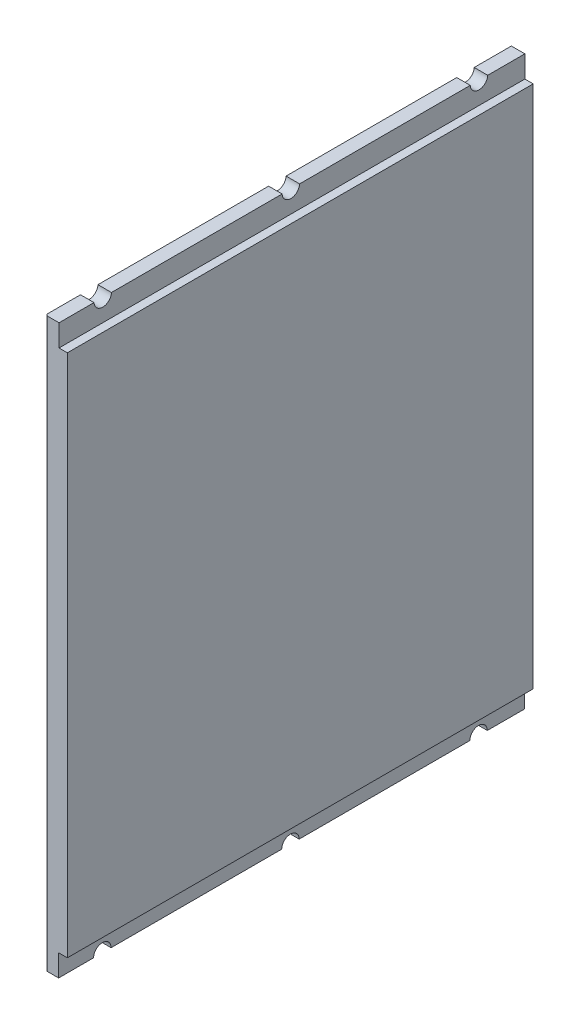
ISO-10303-21;
HEADER;
FILE_DESCRIPTION(('STEP AP214'),'2;1');
FILE_NAME('part.step','',(''),(''),'','','');
FILE_SCHEMA(('AUTOMOTIVE_DESIGN { 1 0 10303 214 1 1 1 1 }'));
ENDSEC;
DATA;
#1=APPLICATION_CONTEXT('core data for automotive mechanical design processes');
#2=APPLICATION_PROTOCOL_DEFINITION('international standard','automotive_design',2000,#1);
#3=PRODUCT_CONTEXT('',#1,'mechanical');
#4=PRODUCT('Part','Part','',(#3));
#5=PRODUCT_RELATED_PRODUCT_CATEGORY('part','',(#4));
#6=PRODUCT_DEFINITION_FORMATION('','',#4);
#7=PRODUCT_DEFINITION_CONTEXT('part definition',#1,'design');
#8=PRODUCT_DEFINITION('design','',#6,#7);
#9=PRODUCT_DEFINITION_SHAPE('','',#8);
#10=(LENGTH_UNIT() NAMED_UNIT(*) SI_UNIT(.MILLI.,.METRE.));
#11=(NAMED_UNIT(*) PLANE_ANGLE_UNIT() SI_UNIT($,.RADIAN.));
#12=(NAMED_UNIT(*) SI_UNIT($,.STERADIAN.) SOLID_ANGLE_UNIT());
#13=UNCERTAINTY_MEASURE_WITH_UNIT(LENGTH_MEASURE(1.E-05),#10,'distance_accuracy_value','');
#14=(GEOMETRIC_REPRESENTATION_CONTEXT(3) GLOBAL_UNCERTAINTY_ASSIGNED_CONTEXT((#13)) GLOBAL_UNIT_ASSIGNED_CONTEXT((#10,
#11,#12)) REPRESENTATION_CONTEXT('',''));
#15=CARTESIAN_POINT('',(0.,0.,0.));
#16=DIRECTION('',(0.,0.,1.));
#17=DIRECTION('',(1.,0.,0.));
#18=AXIS2_PLACEMENT_3D('',#15,#16,#17);
#19=CARTESIAN_POINT('',(3.0954492315529,164.904550768447,2.99000000000001));
#20=DIRECTION('',(-1.,0.,0.));
#21=DIRECTION('',(0.,-1.,0.));
#22=AXIS2_PLACEMENT_3D('',#19,#20,#21);
#23=PLANE('',#22);
#24=DIRECTION('',(0.,0.,1.));
#25=VECTOR('',#24,1.);
#26=CARTESIAN_POINT('',(3.0954492315529,164.904550768447,2.99000000000001));
#27=LINE('',#26,#25);
#28=CARTESIAN_POINT('',(3.0954492315529,164.904550768447,3.));
#29=VERTEX_POINT('',#28);
#30=CARTESIAN_POINT('',(3.0954492315529,164.904550768447,11.5022789373399));
#31=VERTEX_POINT('',#30);
#32=EDGE_CURVE('E208',#29,#31,#27,.T.);
#33=ORIENTED_EDGE('',*,*,#32,.T.);
#34=CARTESIAN_POINT('',(3.0954492315529,165.,13.5));
#35=DIRECTION('',(-1.,0.,0.));
#36=DIRECTION('',(0.,-1.,0.));
#37=AXIS2_PLACEMENT_3D('',#34,#35,#36);
#38=CIRCLE('',#37,2.);
#39=CARTESIAN_POINT('',(3.0954492315529,164.904550768447,15.4977210626601));
#40=VERTEX_POINT('',#39);
#41=EDGE_CURVE('E292',#40,#31,#38,.F.);
#42=ORIENTED_EDGE('',*,*,#41,.F.);
#43=CARTESIAN_POINT('',(3.0954492315529,164.904550768447,54.5522789373399));
#44=VERTEX_POINT('',#43);
#45=EDGE_CURVE('E282',#40,#44,#27,.T.);
#46=ORIENTED_EDGE('',*,*,#45,.T.);
#47=CARTESIAN_POINT('',(3.0954492315529,165.,56.55));
#48=DIRECTION('',(-1.,0.,0.));
#49=DIRECTION('',(0.,-1.,0.));
#50=AXIS2_PLACEMENT_3D('',#47,#48,#49);
#51=CIRCLE('',#50,2.);
#52=CARTESIAN_POINT('',(3.0954492315529,164.904550768447,58.5477210626601));
#53=VERTEX_POINT('',#52);
#54=EDGE_CURVE('E290',#53,#44,#51,.F.);
#55=ORIENTED_EDGE('',*,*,#54,.F.);
#56=CARTESIAN_POINT('',(3.0954492315529,164.904550768447,97.6022789373399));
#57=VERTEX_POINT('',#56);
#58=EDGE_CURVE('E277',#53,#57,#27,.T.);
#59=ORIENTED_EDGE('',*,*,#58,.T.);
#60=CARTESIAN_POINT('',(3.0954492315529,165.,99.6));
#61=DIRECTION('',(-1.,0.,0.));
#62=DIRECTION('',(0.,-1.,0.));
#63=AXIS2_PLACEMENT_3D('',#60,#61,#62);
#64=CIRCLE('',#63,2.);
#65=CARTESIAN_POINT('',(3.0954492315529,164.904550768447,101.59772106266));
#66=VERTEX_POINT('',#65);
#67=EDGE_CURVE('E250',#66,#57,#64,.F.);
#68=ORIENTED_EDGE('',*,*,#67,.F.);
#69=CARTESIAN_POINT('',(3.0954492315529,164.904550768447,109.6));
#70=VERTEX_POINT('',#69);
#71=EDGE_CURVE('E275',#66,#70,#27,.T.);
#72=ORIENTED_EDGE('',*,*,#71,.T.);
#73=DIRECTION('',(0.,1.,0.));
#74=VECTOR('',#73,1.);
#75=CARTESIAN_POINT('',(3.09544923155291,0.,109.6));
#76=LINE('',#75,#74);
#77=CARTESIAN_POINT('',(3.0954492315529,159.904550768447,109.6));
#78=VERTEX_POINT('',#77);
#79=EDGE_CURVE('E322',#78,#70,#76,.T.);
#80=ORIENTED_EDGE('',*,*,#79,.F.);
#81=DIRECTION('',(0.,0.,1.));
#82=VECTOR('',#81,1.);
#83=CARTESIAN_POINT('',(3.0954492315529,159.904550768447,2.99000000000001));
#84=LINE('',#83,#82);
#85=CARTESIAN_POINT('',(3.0954492315529,159.904550768447,3.));
#86=VERTEX_POINT('',#85);
#87=EDGE_CURVE('E37',#86,#78,#84,.T.);
#88=ORIENTED_EDGE('',*,*,#87,.F.);
#89=DIRECTION('',(0.,-1.,0.));
#90=VECTOR('',#89,1.);
#91=CARTESIAN_POINT('',(3.09544923155291,0.,3.));
#92=LINE('',#91,#90);
#93=EDGE_CURVE('E315',#29,#86,#92,.T.);
#94=ORIENTED_EDGE('',*,*,#93,.F.);
#95=EDGE_LOOP('',(#33,#42,#46,#55,#59,#68,#72,#80,#88,#94));
#96=FACE_BOUND('',#95,.T.);
#97=ADVANCED_FACE('F33',(#96),#23,.F.);
#98=CARTESIAN_POINT('',(-4.15190183256233,164.904550768447,2.99000000000001));
#99=DIRECTION('',(0.,-1.,0.));
#100=DIRECTION('',(0.,0.,-1.));
#101=AXIS2_PLACEMENT_3D('',#98,#99,#100);
#102=PLANE('',#101);
#103=DIRECTION('',(0.,0.,-1.));
#104=VECTOR('',#103,1.);
#105=CARTESIAN_POINT('',(0.,164.904550768447,109.6));
#106=LINE('',#105,#104);
#107=CARTESIAN_POINT('',(0.,164.904550768447,11.5022789373399));
#108=VERTEX_POINT('',#107);
#109=CARTESIAN_POINT('',(0.,164.904550768447,3.));
#110=VERTEX_POINT('',#109);
#111=EDGE_CURVE('E240',#108,#110,#106,.T.);
#112=ORIENTED_EDGE('',*,*,#111,.F.);
#113=DIRECTION('',(-1.,0.,0.));
#114=VECTOR('',#113,1.);
#115=CARTESIAN_POINT('',(10.,164.904550768447,11.5022789373399));
#116=LINE('',#115,#114);
#117=EDGE_CURVE('E318',#31,#108,#116,.T.);
#118=ORIENTED_EDGE('',*,*,#117,.F.);
#119=ORIENTED_EDGE('',*,*,#32,.F.);
#120=DIRECTION('',(1.,0.,0.));
#121=VECTOR('',#120,1.);
#122=CARTESIAN_POINT('',(-0.01000000000001,164.904550768447,3.));
#123=LINE('',#122,#121);
#124=EDGE_CURVE('E233',#110,#29,#123,.T.);
#125=ORIENTED_EDGE('',*,*,#124,.F.);
#126=EDGE_LOOP('',(#112,#118,#119,#125));
#127=FACE_BOUND('',#126,.T.);
#128=ADVANCED_FACE('F384',(#127),#102,.F.);
#129=CARTESIAN_POINT('',(5.,159.904550768447,2.99000000000001));
#130=DIRECTION('',(0.,-1.,0.));
#131=DIRECTION('',(0.,0.,-1.));
#132=AXIS2_PLACEMENT_3D('',#129,#130,#131);
#133=PLANE('',#132);
#134=ORIENTED_EDGE('',*,*,#87,.T.);
#135=DIRECTION('',(-1.,0.,0.));
#136=VECTOR('',#135,1.);
#137=CARTESIAN_POINT('',(0.,159.904550768447,109.6));
#138=LINE('',#137,#136);
#139=CARTESIAN_POINT('',(5.,159.904550768447,109.6));
#140=VERTEX_POINT('',#139);
#141=EDGE_CURVE('E324',#140,#78,#138,.T.);
#142=ORIENTED_EDGE('',*,*,#141,.F.);
#143=DIRECTION('',(0.,0.,1.));
#144=VECTOR('',#143,1.);
#145=CARTESIAN_POINT('',(5.,159.904550768447,2.99000000000001));
#146=LINE('',#145,#144);
#147=CARTESIAN_POINT('',(5.,159.904550768447,3.));
#148=VERTEX_POINT('',#147);
#149=EDGE_CURVE('E235',#148,#140,#146,.T.);
#150=ORIENTED_EDGE('',*,*,#149,.F.);
#151=DIRECTION('',(1.,0.,0.));
#152=VECTOR('',#151,1.);
#153=CARTESIAN_POINT('',(-0.01000000000001,159.904550768447,3.));
#154=LINE('',#153,#152);
#155=EDGE_CURVE('E317',#86,#148,#154,.T.);
#156=ORIENTED_EDGE('',*,*,#155,.F.);
#157=EDGE_LOOP('',(#134,#142,#150,#156));
#158=FACE_BOUND('',#157,.T.);
#159=ADVANCED_FACE('F385',(#158),#133,.F.);
#160=CARTESIAN_POINT('',(0.5,164.904550768447,109.1));
#161=DIRECTION('',(0.,-1.,0.));
#162=DIRECTION('',(0.,0.,-1.));
#163=AXIS2_PLACEMENT_3D('',#160,#161,#162);
#164=CIRCLE('',#163,0.5);
#165=CARTESIAN_POINT('',(0.,164.904550768447,109.1));
#166=VERTEX_POINT('',#165);
#167=CARTESIAN_POINT('',(0.5,164.904550768447,109.6));
#168=VERTEX_POINT('',#167);
#169=EDGE_CURVE('E211',#166,#168,#164,.F.);
#170=ORIENTED_EDGE('',*,*,#169,.T.);
#171=DIRECTION('',(-1.,0.,0.));
#172=VECTOR('',#171,1.);
#173=CARTESIAN_POINT('',(0.,164.904550768447,109.6));
#174=LINE('',#173,#172);
#175=EDGE_CURVE('E245',#70,#168,#174,.T.);
#176=ORIENTED_EDGE('',*,*,#175,.F.);
#177=ORIENTED_EDGE('',*,*,#71,.F.);
#178=DIRECTION('',(-1.,0.,0.));
#179=VECTOR('',#178,1.);
#180=CARTESIAN_POINT('',(10.,164.904550768447,101.59772106266));
#181=LINE('',#180,#179);
#182=CARTESIAN_POINT('',(0.,164.904550768447,101.59772106266));
#183=VERTEX_POINT('',#182);
#184=EDGE_CURVE('E305',#183,#66,#181,.F.);
#185=ORIENTED_EDGE('',*,*,#184,.F.);
#186=EDGE_CURVE('E312',#166,#183,#106,.T.);
#187=ORIENTED_EDGE('',*,*,#186,.F.);
#188=EDGE_LOOP('',(#170,#176,#177,#185,#187));
#189=FACE_BOUND('',#188,.T.);
#190=ADVANCED_FACE('F374',(#189),#102,.F.);
#191=CARTESIAN_POINT('',(0.,164.904550768447,97.6022789373399));
#192=VERTEX_POINT('',#191);
#193=CARTESIAN_POINT('',(0.,164.904550768447,58.5477210626601));
#194=VERTEX_POINT('',#193);
#195=EDGE_CURVE('E314',#192,#194,#106,.T.);
#196=ORIENTED_EDGE('',*,*,#195,.F.);
#197=DIRECTION('',(-1.,0.,0.));
#198=VECTOR('',#197,1.);
#199=CARTESIAN_POINT('',(10.,164.904550768447,97.6022789373399));
#200=LINE('',#199,#198);
#201=EDGE_CURVE('E329',#57,#192,#200,.T.);
#202=ORIENTED_EDGE('',*,*,#201,.F.);
#203=ORIENTED_EDGE('',*,*,#58,.F.);
#204=DIRECTION('',(-1.,0.,0.));
#205=VECTOR('',#204,1.);
#206=CARTESIAN_POINT('',(10.,164.904550768447,58.5477210626601));
#207=LINE('',#206,#205);
#208=EDGE_CURVE('E303',#194,#53,#207,.F.);
#209=ORIENTED_EDGE('',*,*,#208,.F.);
#210=EDGE_LOOP('',(#196,#202,#203,#209));
#211=FACE_BOUND('',#210,.T.);
#212=ADVANCED_FACE('F377',(#211),#102,.F.);
#213=CARTESIAN_POINT('',(0.,164.904550768447,54.5522789373399));
#214=VERTEX_POINT('',#213);
#215=CARTESIAN_POINT('',(0.,164.904550768447,15.4977210626601));
#216=VERTEX_POINT('',#215);
#217=EDGE_CURVE('E299',#214,#216,#106,.T.);
#218=ORIENTED_EDGE('',*,*,#217,.F.);
#219=DIRECTION('',(-1.,0.,0.));
#220=VECTOR('',#219,1.);
#221=CARTESIAN_POINT('',(10.,164.904550768447,54.5522789373399));
#222=LINE('',#221,#220);
#223=EDGE_CURVE('E296',#44,#214,#222,.T.);
#224=ORIENTED_EDGE('',*,*,#223,.F.);
#225=ORIENTED_EDGE('',*,*,#45,.F.);
#226=DIRECTION('',(-1.,0.,0.));
#227=VECTOR('',#226,1.);
#228=CARTESIAN_POINT('',(10.,164.904550768447,15.4977210626601));
#229=LINE('',#228,#227);
#230=EDGE_CURVE('E309',#216,#40,#229,.F.);
#231=ORIENTED_EDGE('',*,*,#230,.F.);
#232=EDGE_LOOP('',(#218,#224,#225,#231));
#233=FACE_BOUND('',#232,.T.);
#234=ADVANCED_FACE('F297',(#233),#102,.F.);
#235=CARTESIAN_POINT('',(-24.2516647448894,35.,2.99000000000001));
#236=DIRECTION('',(0.,1.,0.));
#237=DIRECTION('',(0.,0.,1.));
#238=AXIS2_PLACEMENT_3D('',#235,#236,#237);
#239=PLANE('',#238);
#240=DIRECTION('',(0.,0.,1.));
#241=VECTOR('',#240,1.);
#242=CARTESIAN_POINT('',(3.,35.,2.99000000000001));
#243=LINE('',#242,#241);
#244=CARTESIAN_POINT('',(3.,35.,3.));
#245=VERTEX_POINT('',#244);
#246=CARTESIAN_POINT('',(3.,35.,11.5));
#247=VERTEX_POINT('',#246);
#248=EDGE_CURVE('E199',#245,#247,#243,.T.);
#249=ORIENTED_EDGE('',*,*,#248,.T.);
#250=DIRECTION('',(-1.,0.,0.));
#251=VECTOR('',#250,1.);
#252=CARTESIAN_POINT('',(10.,35.,11.5));
#253=LINE('',#252,#251);
#254=CARTESIAN_POINT('',(0.,35.,11.5));
#255=VERTEX_POINT('',#254);
#256=EDGE_CURVE('E190',#255,#247,#253,.F.);
#257=ORIENTED_EDGE('',*,*,#256,.F.);
#258=DIRECTION('',(0.,0.,1.));
#259=VECTOR('',#258,1.);
#260=CARTESIAN_POINT('',(0.,35.,109.6));
#261=LINE('',#260,#259);
#262=CARTESIAN_POINT('',(0.,35.,3.));
#263=VERTEX_POINT('',#262);
#264=EDGE_CURVE('E50',#263,#255,#261,.T.);
#265=ORIENTED_EDGE('',*,*,#264,.F.);
#266=DIRECTION('',(-1.,0.,0.));
#267=VECTOR('',#266,1.);
#268=CARTESIAN_POINT('',(-0.01000000000001,35.,3.));
#269=LINE('',#268,#267);
#270=EDGE_CURVE('E231',#245,#263,#269,.T.);
#271=ORIENTED_EDGE('',*,*,#270,.F.);
#272=EDGE_LOOP('',(#249,#257,#265,#271));
#273=FACE_BOUND('',#272,.T.);
#274=ADVANCED_FACE('F352',(#273),#239,.F.);
#275=CARTESIAN_POINT('',(0.,35.,15.5));
#276=VERTEX_POINT('',#275);
#277=CARTESIAN_POINT('',(0.,35.,54.55));
#278=VERTEX_POINT('',#277);
#279=EDGE_CURVE('E184',#276,#278,#261,.T.);
#280=ORIENTED_EDGE('',*,*,#279,.F.);
#281=DIRECTION('',(-1.,0.,0.));
#282=VECTOR('',#281,1.);
#283=CARTESIAN_POINT('',(10.,35.,15.5));
#284=LINE('',#283,#282);
#285=CARTESIAN_POINT('',(3.,35.,15.5));
#286=VERTEX_POINT('',#285);
#287=EDGE_CURVE('E57',#286,#276,#284,.T.);
#288=ORIENTED_EDGE('',*,*,#287,.F.);
#289=CARTESIAN_POINT('',(3.,35.,54.55));
#290=VERTEX_POINT('',#289);
#291=EDGE_CURVE('E181',#286,#290,#243,.T.);
#292=ORIENTED_EDGE('',*,*,#291,.T.);
#293=DIRECTION('',(-1.,0.,0.));
#294=VECTOR('',#293,1.);
#295=CARTESIAN_POINT('',(10.,35.,54.55));
#296=LINE('',#295,#294);
#297=EDGE_CURVE('E254',#278,#290,#296,.F.);
#298=ORIENTED_EDGE('',*,*,#297,.F.);
#299=EDGE_LOOP('',(#280,#288,#292,#298));
#300=FACE_BOUND('',#299,.T.);
#301=ADVANCED_FACE('F179',(#300),#239,.F.);
#302=CARTESIAN_POINT('',(3.,40.,2.99000000000001));
#303=DIRECTION('',(-1.,0.,0.));
#304=DIRECTION('',(0.,-1.,0.));
#305=AXIS2_PLACEMENT_3D('',#302,#303,#304);
#306=PLANE('',#305);
#307=DIRECTION('',(0.,0.,1.));
#308=VECTOR('',#307,1.);
#309=CARTESIAN_POINT('',(3.,40.,2.99000000000001));
#310=LINE('',#309,#308);
#311=CARTESIAN_POINT('',(3.,40.,3.));
#312=VERTEX_POINT('',#311);
#313=CARTESIAN_POINT('',(3.,40.,109.6));
#314=VERTEX_POINT('',#313);
#315=EDGE_CURVE('E202',#312,#314,#310,.T.);
#316=ORIENTED_EDGE('',*,*,#315,.T.);
#317=DIRECTION('',(0.,1.,0.));
#318=VECTOR('',#317,1.);
#319=CARTESIAN_POINT('',(3.,0.,109.6));
#320=LINE('',#319,#318);
#321=CARTESIAN_POINT('',(3.,35.,109.6));
#322=VERTEX_POINT('',#321);
#323=EDGE_CURVE('E239',#322,#314,#320,.T.);
#324=ORIENTED_EDGE('',*,*,#323,.F.);
#325=CARTESIAN_POINT('',(3.,35.,101.6));
#326=VERTEX_POINT('',#325);
#327=EDGE_CURVE('E203',#326,#322,#243,.T.);
#328=ORIENTED_EDGE('',*,*,#327,.F.);
#329=CARTESIAN_POINT('',(3.,35.,99.6));
#330=DIRECTION('',(-1.,0.,0.));
#331=DIRECTION('',(0.,-1.,0.));
#332=AXIS2_PLACEMENT_3D('',#329,#330,#331);
#333=CIRCLE('',#332,2.);
#334=CARTESIAN_POINT('',(3.,35.,97.6));
#335=VERTEX_POINT('',#334);
#336=EDGE_CURVE('E249',#335,#326,#333,.F.);
#337=ORIENTED_EDGE('',*,*,#336,.F.);
#338=CARTESIAN_POINT('',(3.,35.,58.55));
#339=VERTEX_POINT('',#338);
#340=EDGE_CURVE('E200',#339,#335,#243,.T.);
#341=ORIENTED_EDGE('',*,*,#340,.F.);
#342=CARTESIAN_POINT('',(3.,35.,56.55));
#343=DIRECTION('',(-1.,0.,0.));
#344=DIRECTION('',(0.,-1.,0.));
#345=AXIS2_PLACEMENT_3D('',#342,#343,#344);
#346=CIRCLE('',#345,2.00000000000001);
#347=EDGE_CURVE('E198',#290,#339,#346,.F.);
#348=ORIENTED_EDGE('',*,*,#347,.F.);
#349=ORIENTED_EDGE('',*,*,#291,.F.);
#350=CARTESIAN_POINT('',(3.,35.,13.5));
#351=DIRECTION('',(-1.,0.,0.));
#352=DIRECTION('',(0.,-1.,0.));
#353=AXIS2_PLACEMENT_3D('',#350,#351,#352);
#354=CIRCLE('',#353,2.);
#355=EDGE_CURVE('E186',#247,#286,#354,.F.);
#356=ORIENTED_EDGE('',*,*,#355,.F.);
#357=ORIENTED_EDGE('',*,*,#248,.F.);
#358=DIRECTION('',(0.,-1.,0.));
#359=VECTOR('',#358,1.);
#360=CARTESIAN_POINT('',(3.,0.,3.));
#361=LINE('',#360,#359);
#362=EDGE_CURVE('E228',#312,#245,#361,.T.);
#363=ORIENTED_EDGE('',*,*,#362,.F.);
#364=EDGE_LOOP('',(#316,#324,#328,#337,#341,#348,#349,#356,#357,#363));
#365=FACE_BOUND('',#364,.T.);
#366=ADVANCED_FACE('F196',(#365),#306,.F.);
#367=CARTESIAN_POINT('',(5.,40.,2.99000000000001));
#368=DIRECTION('',(0.,1.,0.));
#369=DIRECTION('',(0.,0.,1.));
#370=AXIS2_PLACEMENT_3D('',#367,#368,#369);
#371=PLANE('',#370);
#372=DIRECTION('',(0.,0.,1.));
#373=VECTOR('',#372,1.);
#374=CARTESIAN_POINT('',(5.,40.,109.6));
#375=LINE('',#374,#373);
#376=CARTESIAN_POINT('',(5.,40.,3.));
#377=VERTEX_POINT('',#376);
#378=CARTESIAN_POINT('',(5.,40.,109.6));
#379=VERTEX_POINT('',#378);
#380=EDGE_CURVE('E222',#377,#379,#375,.T.);
#381=ORIENTED_EDGE('',*,*,#380,.T.);
#382=DIRECTION('',(1.,0.,0.));
#383=VECTOR('',#382,1.);
#384=CARTESIAN_POINT('',(0.,40.,109.6));
#385=LINE('',#384,#383);
#386=EDGE_CURVE('E237',#314,#379,#385,.T.);
#387=ORIENTED_EDGE('',*,*,#386,.F.);
#388=ORIENTED_EDGE('',*,*,#315,.F.);
#389=DIRECTION('',(-1.,0.,0.));
#390=VECTOR('',#389,1.);
#391=CARTESIAN_POINT('',(-0.01000000000001,40.,3.));
#392=LINE('',#391,#390);
#393=EDGE_CURVE('E225',#377,#312,#392,.T.);
#394=ORIENTED_EDGE('',*,*,#393,.F.);
#395=EDGE_LOOP('',(#381,#387,#388,#394));
#396=FACE_BOUND('',#395,.T.);
#397=ADVANCED_FACE('F409',(#396),#371,.F.);
#398=CARTESIAN_POINT('',(0.,35.,58.55));
#399=VERTEX_POINT('',#398);
#400=CARTESIAN_POINT('',(0.,35.,97.6));
#401=VERTEX_POINT('',#400);
#402=EDGE_CURVE('E355',#399,#401,#261,.T.);
#403=ORIENTED_EDGE('',*,*,#402,.F.);
#404=DIRECTION('',(-1.,0.,0.));
#405=VECTOR('',#404,1.);
#406=CARTESIAN_POINT('',(10.,35.,58.55));
#407=LINE('',#406,#405);
#408=EDGE_CURVE('E257',#339,#399,#407,.T.);
#409=ORIENTED_EDGE('',*,*,#408,.F.);
#410=ORIENTED_EDGE('',*,*,#340,.T.);
#411=DIRECTION('',(-1.,0.,0.));
#412=VECTOR('',#411,1.);
#413=CARTESIAN_POINT('',(10.,35.,97.6));
#414=LINE('',#413,#412);
#415=EDGE_CURVE('E246',#401,#335,#414,.F.);
#416=ORIENTED_EDGE('',*,*,#415,.F.);
#417=EDGE_LOOP('',(#403,#409,#410,#416));
#418=FACE_BOUND('',#417,.T.);
#419=ADVANCED_FACE('F361',(#418),#239,.F.);
#420=CARTESIAN_POINT('',(0.5,35.,109.1));
#421=DIRECTION('',(0.,1.,0.));
#422=DIRECTION('',(0.,0.,1.));
#423=AXIS2_PLACEMENT_3D('',#420,#421,#422);
#424=CIRCLE('',#423,0.5);
#425=CARTESIAN_POINT('',(0.5,35.,109.6));
#426=VERTEX_POINT('',#425);
#427=CARTESIAN_POINT('',(0.,35.,109.1));
#428=VERTEX_POINT('',#427);
#429=EDGE_CURVE('E219',#426,#428,#424,.F.);
#430=ORIENTED_EDGE('',*,*,#429,.T.);
#431=CARTESIAN_POINT('',(0.,35.,101.6));
#432=VERTEX_POINT('',#431);
#433=EDGE_CURVE('E236',#432,#428,#261,.T.);
#434=ORIENTED_EDGE('',*,*,#433,.F.);
#435=DIRECTION('',(-1.,0.,0.));
#436=VECTOR('',#435,1.);
#437=CARTESIAN_POINT('',(10.,35.,101.6));
#438=LINE('',#437,#436);
#439=EDGE_CURVE('E252',#326,#432,#438,.T.);
#440=ORIENTED_EDGE('',*,*,#439,.F.);
#441=ORIENTED_EDGE('',*,*,#327,.T.);
#442=DIRECTION('',(1.,0.,0.));
#443=VECTOR('',#442,1.);
#444=CARTESIAN_POINT('',(0.,35.,109.6));
#445=LINE('',#444,#443);
#446=EDGE_CURVE('E242',#426,#322,#445,.T.);
#447=ORIENTED_EDGE('',*,*,#446,.F.);
#448=EDGE_LOOP('',(#430,#434,#440,#441,#447));
#449=FACE_BOUND('',#448,.T.);
#450=ADVANCED_FACE('F368',(#449),#239,.F.);
#451=CARTESIAN_POINT('',(-0.01000000000001,0.,3.));
#452=DIRECTION('',(0.,0.,1.));
#453=DIRECTION('',(1.,0.,0.));
#454=AXIS2_PLACEMENT_3D('',#451,#452,#453);
#455=PLANE('',#454);
#456=DIRECTION('',(0.,-1.,0.));
#457=VECTOR('',#456,1.);
#458=CARTESIAN_POINT('',(5.,192.,3.));
#459=LINE('',#458,#457);
#460=EDGE_CURVE('E185',#148,#377,#459,.T.);
#461=ORIENTED_EDGE('',*,*,#460,.T.);
#462=ORIENTED_EDGE('',*,*,#393,.T.);
#463=ORIENTED_EDGE('',*,*,#362,.T.);
#464=ORIENTED_EDGE('',*,*,#270,.T.);
#465=DIRECTION('',(0.,-1.,0.));
#466=VECTOR('',#465,1.);
#467=CARTESIAN_POINT('',(0.,0.,3.));
#468=LINE('',#467,#466);
#469=EDGE_CURVE('E270',#110,#263,#468,.T.);
#470=ORIENTED_EDGE('',*,*,#469,.F.);
#471=ORIENTED_EDGE('',*,*,#124,.T.);
#472=ORIENTED_EDGE('',*,*,#93,.T.);
#473=ORIENTED_EDGE('',*,*,#155,.T.);
#474=EDGE_LOOP('',(#461,#462,#463,#464,#470,#471,#472,#473));
#475=FACE_BOUND('',#474,.T.);
#476=ADVANCED_FACE('F350',(#475),#455,.F.);
#477=CARTESIAN_POINT('',(5.,0.,109.6));
#478=DIRECTION('',(1.,0.,0.));
#479=DIRECTION('',(0.,0.,-1.));
#480=AXIS2_PLACEMENT_3D('',#477,#478,#479);
#481=PLANE('',#480);
#482=ORIENTED_EDGE('',*,*,#380,.F.);
#483=ORIENTED_EDGE('',*,*,#460,.F.);
#484=ORIENTED_EDGE('',*,*,#149,.T.);
#485=DIRECTION('',(0.,-1.,0.));
#486=VECTOR('',#485,1.);
#487=CARTESIAN_POINT('',(5.,0.,109.6));
#488=LINE('',#487,#486);
#489=EDGE_CURVE('E260',#140,#379,#488,.T.);
#490=ORIENTED_EDGE('',*,*,#489,.T.);
#491=EDGE_LOOP('',(#482,#483,#484,#490));
#492=FACE_BOUND('',#491,.T.);
#493=ADVANCED_FACE('F35',(#492),#481,.T.);
#494=CARTESIAN_POINT('',(0.,0.,109.6));
#495=DIRECTION('',(1.,0.,0.));
#496=DIRECTION('',(0.,0.,-1.));
#497=AXIS2_PLACEMENT_3D('',#494,#495,#496);
#498=PLANE('',#497);
#499=ORIENTED_EDGE('',*,*,#469,.T.);
#500=ORIENTED_EDGE('',*,*,#264,.T.);
#501=CARTESIAN_POINT('',(0.,35.,13.5));
#502=DIRECTION('',(-1.,0.,0.));
#503=DIRECTION('',(0.,0.,-1.));
#504=AXIS2_PLACEMENT_3D('',#501,#502,#503);
#505=CIRCLE('',#504,2.);
#506=EDGE_CURVE('E11',#276,#255,#505,.T.);
#507=ORIENTED_EDGE('',*,*,#506,.F.);
#508=ORIENTED_EDGE('',*,*,#279,.T.);
#509=CARTESIAN_POINT('',(0.,35.,56.55));
#510=DIRECTION('',(-1.,0.,0.));
#511=DIRECTION('',(0.,0.,-1.));
#512=AXIS2_PLACEMENT_3D('',#509,#510,#511);
#513=CIRCLE('',#512,2.00000000000001);
#514=EDGE_CURVE('E42',#399,#278,#513,.T.);
#515=ORIENTED_EDGE('',*,*,#514,.F.);
#516=ORIENTED_EDGE('',*,*,#402,.T.);
#517=CARTESIAN_POINT('',(0.,35.,99.6));
#518=DIRECTION('',(-1.,0.,0.));
#519=DIRECTION('',(0.,0.,-1.));
#520=AXIS2_PLACEMENT_3D('',#517,#518,#519);
#521=CIRCLE('',#520,2.);
#522=EDGE_CURVE('E215',#432,#401,#521,.T.);
#523=ORIENTED_EDGE('',*,*,#522,.F.);
#524=ORIENTED_EDGE('',*,*,#433,.T.);
#525=DIRECTION('',(0.,-1.,0.));
#526=VECTOR('',#525,1.);
#527=CARTESIAN_POINT('',(0.,0.,109.1));
#528=LINE('',#527,#526);
#529=EDGE_CURVE('E267',#428,#166,#528,.F.);
#530=ORIENTED_EDGE('',*,*,#529,.T.);
#531=ORIENTED_EDGE('',*,*,#186,.T.);
#532=CARTESIAN_POINT('',(0.,165.,99.6));
#533=DIRECTION('',(-1.,0.,0.));
#534=DIRECTION('',(0.,0.,1.));
#535=AXIS2_PLACEMENT_3D('',#532,#533,#534);
#536=CIRCLE('',#535,2.);
#537=EDGE_CURVE('E218',#192,#183,#536,.T.);
#538=ORIENTED_EDGE('',*,*,#537,.F.);
#539=ORIENTED_EDGE('',*,*,#195,.T.);
#540=CARTESIAN_POINT('',(0.,165.,56.55));
#541=DIRECTION('',(-1.,0.,0.));
#542=DIRECTION('',(0.,0.,1.));
#543=AXIS2_PLACEMENT_3D('',#540,#541,#542);
#544=CIRCLE('',#543,2.);
#545=EDGE_CURVE('E209',#214,#194,#544,.T.);
#546=ORIENTED_EDGE('',*,*,#545,.F.);
#547=ORIENTED_EDGE('',*,*,#217,.T.);
#548=CARTESIAN_POINT('',(0.,165.,13.5));
#549=DIRECTION('',(-1.,0.,0.));
#550=DIRECTION('',(0.,0.,1.));
#551=AXIS2_PLACEMENT_3D('',#548,#549,#550);
#552=CIRCLE('',#551,2.);
#553=EDGE_CURVE('E263',#108,#216,#552,.T.);
#554=ORIENTED_EDGE('',*,*,#553,.F.);
#555=ORIENTED_EDGE('',*,*,#111,.T.);
#556=EDGE_LOOP('',(#499,#500,#507,#508,#515,#516,#523,#524,#530,#531,#538,#539,#546,#547,#554,#555));
#557=FACE_BOUND('',#556,.T.);
#558=ADVANCED_FACE('F339',(#557),#498,.F.);
#559=CARTESIAN_POINT('',(10.,35.,13.5));
#560=DIRECTION('',(-1.,0.,0.));
#561=DIRECTION('',(0.,0.,1.));
#562=AXIS2_PLACEMENT_3D('',#559,#560,#561);
#563=CYLINDRICAL_SURFACE('',#562,2.);
#564=ORIENTED_EDGE('',*,*,#506,.T.);
#565=ORIENTED_EDGE('',*,*,#256,.T.);
#566=ORIENTED_EDGE('',*,*,#355,.T.);
#567=ORIENTED_EDGE('',*,*,#287,.T.);
#568=EDGE_LOOP('',(#564,#565,#566,#567));
#569=FACE_BOUND('',#568,.T.);
#570=ADVANCED_FACE('F189',(#569),#563,.F.);
#571=CARTESIAN_POINT('',(10.,35.,56.55));
#572=DIRECTION('',(-1.,0.,0.));
#573=DIRECTION('',(0.,0.,1.));
#574=AXIS2_PLACEMENT_3D('',#571,#572,#573);
#575=CYLINDRICAL_SURFACE('',#574,2.00000000000001);
#576=ORIENTED_EDGE('',*,*,#514,.T.);
#577=ORIENTED_EDGE('',*,*,#297,.T.);
#578=ORIENTED_EDGE('',*,*,#347,.T.);
#579=ORIENTED_EDGE('',*,*,#408,.T.);
#580=EDGE_LOOP('',(#576,#577,#578,#579));
#581=FACE_BOUND('',#580,.T.);
#582=ADVANCED_FACE('F357',(#581),#575,.F.);
#583=CARTESIAN_POINT('',(10.,35.,99.6));
#584=DIRECTION('',(-1.,0.,0.));
#585=DIRECTION('',(0.,0.,1.));
#586=AXIS2_PLACEMENT_3D('',#583,#584,#585);
#587=CYLINDRICAL_SURFACE('',#586,2.);
#588=ORIENTED_EDGE('',*,*,#522,.T.);
#589=ORIENTED_EDGE('',*,*,#415,.T.);
#590=ORIENTED_EDGE('',*,*,#336,.T.);
#591=ORIENTED_EDGE('',*,*,#439,.T.);
#592=EDGE_LOOP('',(#588,#589,#590,#591));
#593=FACE_BOUND('',#592,.T.);
#594=ADVANCED_FACE('F402',(#593),#587,.F.);
#595=CARTESIAN_POINT('',(10.,165.,99.6));
#596=DIRECTION('',(-1.,0.,0.));
#597=DIRECTION('',(0.,0.,1.));
#598=AXIS2_PLACEMENT_3D('',#595,#596,#597);
#599=CYLINDRICAL_SURFACE('',#598,2.);
#600=ORIENTED_EDGE('',*,*,#537,.T.);
#601=ORIENTED_EDGE('',*,*,#184,.T.);
#602=ORIENTED_EDGE('',*,*,#67,.T.);
#603=ORIENTED_EDGE('',*,*,#201,.T.);
#604=EDGE_LOOP('',(#600,#601,#602,#603));
#605=FACE_BOUND('',#604,.T.);
#606=ADVANCED_FACE('F376',(#605),#599,.F.);
#607=CARTESIAN_POINT('',(10.,165.,56.55));
#608=DIRECTION('',(-1.,0.,0.));
#609=DIRECTION('',(0.,0.,1.));
#610=AXIS2_PLACEMENT_3D('',#607,#608,#609);
#611=CYLINDRICAL_SURFACE('',#610,2.);
#612=ORIENTED_EDGE('',*,*,#545,.T.);
#613=ORIENTED_EDGE('',*,*,#208,.T.);
#614=ORIENTED_EDGE('',*,*,#54,.T.);
#615=ORIENTED_EDGE('',*,*,#223,.T.);
#616=EDGE_LOOP('',(#612,#613,#614,#615));
#617=FACE_BOUND('',#616,.T.);
#618=ADVANCED_FACE('F336',(#617),#611,.F.);
#619=CARTESIAN_POINT('',(10.,165.,13.5));
#620=DIRECTION('',(-1.,0.,0.));
#621=DIRECTION('',(0.,0.,1.));
#622=AXIS2_PLACEMENT_3D('',#619,#620,#621);
#623=CYLINDRICAL_SURFACE('',#622,2.);
#624=ORIENTED_EDGE('',*,*,#553,.T.);
#625=ORIENTED_EDGE('',*,*,#230,.T.);
#626=ORIENTED_EDGE('',*,*,#41,.T.);
#627=ORIENTED_EDGE('',*,*,#117,.T.);
#628=EDGE_LOOP('',(#624,#625,#626,#627));
#629=FACE_BOUND('',#628,.T.);
#630=ADVANCED_FACE('F395',(#629),#623,.F.);
#631=CARTESIAN_POINT('',(0.,0.,109.6));
#632=DIRECTION('',(0.,0.,-1.));
#633=DIRECTION('',(-1.,0.,0.));
#634=AXIS2_PLACEMENT_3D('',#631,#632,#633);
#635=PLANE('',#634);
#636=ORIENTED_EDGE('',*,*,#323,.T.);
#637=ORIENTED_EDGE('',*,*,#386,.T.);
#638=ORIENTED_EDGE('',*,*,#489,.F.);
#639=ORIENTED_EDGE('',*,*,#141,.T.);
#640=ORIENTED_EDGE('',*,*,#79,.T.);
#641=ORIENTED_EDGE('',*,*,#175,.T.);
#642=DIRECTION('',(0.,-1.,0.));
#643=VECTOR('',#642,1.);
#644=CARTESIAN_POINT('',(0.5,0.,109.6));
#645=LINE('',#644,#643);
#646=EDGE_CURVE('E264',#168,#426,#645,.T.);
#647=ORIENTED_EDGE('',*,*,#646,.T.);
#648=ORIENTED_EDGE('',*,*,#446,.T.);
#649=EDGE_LOOP('',(#636,#637,#638,#639,#640,#641,#647,#648));
#650=FACE_BOUND('',#649,.T.);
#651=ADVANCED_FACE('F398',(#650),#635,.F.);
#652=CARTESIAN_POINT('',(0.5,0.,109.1));
#653=DIRECTION('',(0.,-1.,0.));
#654=DIRECTION('',(0.,0.,-1.));
#655=AXIS2_PLACEMENT_3D('',#652,#653,#654);
#656=CYLINDRICAL_SURFACE('',#655,0.5);
#657=ORIENTED_EDGE('',*,*,#429,.F.);
#658=ORIENTED_EDGE('',*,*,#646,.F.);
#659=ORIENTED_EDGE('',*,*,#169,.F.);
#660=ORIENTED_EDGE('',*,*,#529,.F.);
#661=EDGE_LOOP('',(#657,#658,#659,#660));
#662=FACE_BOUND('',#661,.T.);
#663=ADVANCED_FACE('F372',(#662),#656,.T.);
#664=CLOSED_SHELL('',(#97,#128,#159,#190,#212,#234,#274,#301,#366,#397,#419,#450,#476,#493,#558,
#570,#582,#594,#606,#618,#630,#651,#663));
#665=MANIFOLD_SOLID_BREP('B2',#664);
#666=ADVANCED_BREP_SHAPE_REPRESENTATION('',(#18,#665),#14);
#667=SHAPE_DEFINITION_REPRESENTATION(#9,#666);
ENDSEC;
END-ISO-10303-21;
